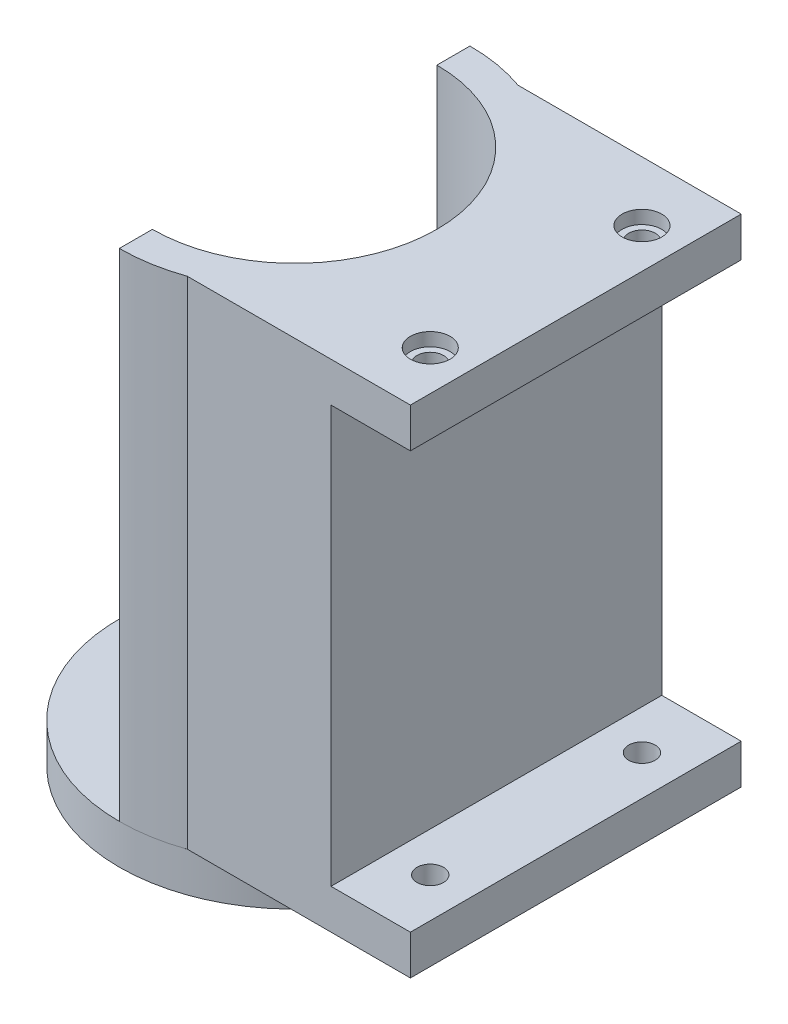
ISO-10303-21;
HEADER;
FILE_DESCRIPTION(('STEP AP214'),'2;1');
FILE_NAME('part.step','',(''),(''),'','','');
FILE_SCHEMA(('AUTOMOTIVE_DESIGN { 1 0 10303 214 1 1 1 1 }'));
ENDSEC;
DATA;
#1=APPLICATION_CONTEXT('core data for automotive mechanical design processes');
#2=APPLICATION_PROTOCOL_DEFINITION('international standard','automotive_design',2000,#1);
#3=PRODUCT_CONTEXT('',#1,'mechanical');
#4=PRODUCT('Part','Part','',(#3));
#5=PRODUCT_RELATED_PRODUCT_CATEGORY('part','',(#4));
#6=PRODUCT_DEFINITION_FORMATION('','',#4);
#7=PRODUCT_DEFINITION_CONTEXT('part definition',#1,'design');
#8=PRODUCT_DEFINITION('design','',#6,#7);
#9=PRODUCT_DEFINITION_SHAPE('','',#8);
#10=(LENGTH_UNIT() NAMED_UNIT(*) SI_UNIT(.MILLI.,.METRE.));
#11=(NAMED_UNIT(*) PLANE_ANGLE_UNIT() SI_UNIT($,.RADIAN.));
#12=(NAMED_UNIT(*) SI_UNIT($,.STERADIAN.) SOLID_ANGLE_UNIT());
#13=UNCERTAINTY_MEASURE_WITH_UNIT(LENGTH_MEASURE(1.E-05),#10,'distance_accuracy_value','');
#14=(GEOMETRIC_REPRESENTATION_CONTEXT(3) GLOBAL_UNCERTAINTY_ASSIGNED_CONTEXT((#13)) GLOBAL_UNIT_ASSIGNED_CONTEXT((#10,
#11,#12)) REPRESENTATION_CONTEXT('',''));
#15=CARTESIAN_POINT('',(0.,0.,0.));
#16=DIRECTION('',(0.,0.,1.));
#17=DIRECTION('',(1.,0.,0.));
#18=AXIS2_PLACEMENT_3D('',#15,#16,#17);
#19=CARTESIAN_POINT('',(18.25,0.,8.));
#20=DIRECTION('',(0.,1.,0.));
#21=DIRECTION('',(0.,0.,1.));
#22=AXIS2_PLACEMENT_3D('',#19,#20,#21);
#23=CYLINDRICAL_SURFACE('',#22,1.);
#24=CARTESIAN_POINT('',(18.25,6.,8.));
#25=DIRECTION('',(0.,-1.,0.));
#26=DIRECTION('',(0.,0.,-1.));
#27=AXIS2_PLACEMENT_3D('',#24,#25,#26);
#28=CIRCLE('',#27,1.);
#29=CARTESIAN_POINT('',(18.25,6.,7.));
#30=VERTEX_POINT('',#29);
#31=EDGE_CURVE('E233',#30,#30,#28,.T.);
#32=ORIENTED_EDGE('',*,*,#31,.F.);
#33=EDGE_LOOP('',(#32));
#34=FACE_BOUND('',#33,.T.);
#35=CARTESIAN_POINT('',(18.25,4.,8.));
#36=DIRECTION('',(0.,-1.,0.));
#37=DIRECTION('',(0.,0.,-1.));
#38=AXIS2_PLACEMENT_3D('',#35,#36,#37);
#39=CIRCLE('',#38,1.);
#40=CARTESIAN_POINT('',(18.25,4.,7.));
#41=VERTEX_POINT('',#40);
#42=EDGE_CURVE('E50',#41,#41,#39,.F.);
#43=ORIENTED_EDGE('',*,*,#42,.F.);
#44=EDGE_LOOP('',(#43));
#45=FACE_BOUND('',#44,.T.);
#46=ADVANCED_FACE('F46',(#34,#45),#23,.F.);
#47=CARTESIAN_POINT('',(18.25,0.,-8.));
#48=DIRECTION('',(0.,1.,0.));
#49=DIRECTION('',(0.,0.,1.));
#50=AXIS2_PLACEMENT_3D('',#47,#48,#49);
#51=CYLINDRICAL_SURFACE('',#50,1.);
#52=CARTESIAN_POINT('',(18.25,6.,-8.));
#53=DIRECTION('',(0.,-1.,0.));
#54=DIRECTION('',(0.,0.,-1.));
#55=AXIS2_PLACEMENT_3D('',#52,#53,#54);
#56=CIRCLE('',#55,1.);
#57=CARTESIAN_POINT('',(18.25,6.,-9.));
#58=VERTEX_POINT('',#57);
#59=EDGE_CURVE('E238',#58,#58,#56,.T.);
#60=ORIENTED_EDGE('',*,*,#59,.F.);
#61=EDGE_LOOP('',(#60));
#62=FACE_BOUND('',#61,.T.);
#63=CARTESIAN_POINT('',(18.25,4.,-8.));
#64=DIRECTION('',(0.,-1.,0.));
#65=DIRECTION('',(0.,0.,-1.));
#66=AXIS2_PLACEMENT_3D('',#63,#64,#65);
#67=CIRCLE('',#66,1.);
#68=CARTESIAN_POINT('',(18.25,4.,-9.));
#69=VERTEX_POINT('',#68);
#70=EDGE_CURVE('E246',#69,#69,#67,.F.);
#71=ORIENTED_EDGE('',*,*,#70,.F.);
#72=EDGE_LOOP('',(#71));
#73=FACE_BOUND('',#72,.T.);
#74=ADVANCED_FACE('F286',(#62,#73),#51,.F.);
#75=CARTESIAN_POINT('',(18.25,37.5,8.));
#76=DIRECTION('',(0.,1.,0.));
#77=DIRECTION('',(0.,0.,1.));
#78=AXIS2_PLACEMENT_3D('',#75,#76,#77);
#79=CIRCLE('',#78,1.);
#80=CARTESIAN_POINT('',(18.25,37.5,9.));
#81=VERTEX_POINT('',#80);
#82=EDGE_CURVE('E236',#81,#81,#79,.T.);
#83=ORIENTED_EDGE('',*,*,#82,.F.);
#84=EDGE_LOOP('',(#83));
#85=FACE_BOUND('',#84,.T.);
#86=CARTESIAN_POINT('',(18.25,39.5,8.));
#87=DIRECTION('',(0.,1.,0.));
#88=DIRECTION('',(0.,0.,1.));
#89=AXIS2_PLACEMENT_3D('',#86,#87,#88);
#90=CIRCLE('',#89,1.);
#91=CARTESIAN_POINT('',(18.25,39.5,9.));
#92=VERTEX_POINT('',#91);
#93=EDGE_CURVE('E237',#92,#92,#90,.F.);
#94=ORIENTED_EDGE('',*,*,#93,.F.);
#95=EDGE_LOOP('',(#94));
#96=FACE_BOUND('',#95,.T.);
#97=ADVANCED_FACE('F282',(#85,#96),#23,.F.);
#98=CARTESIAN_POINT('',(18.25,37.5,-8.));
#99=DIRECTION('',(0.,1.,0.));
#100=DIRECTION('',(0.,0.,1.));
#101=AXIS2_PLACEMENT_3D('',#98,#99,#100);
#102=CIRCLE('',#101,1.);
#103=CARTESIAN_POINT('',(18.25,37.5,-7.));
#104=VERTEX_POINT('',#103);
#105=EDGE_CURVE('E162',#104,#104,#102,.T.);
#106=ORIENTED_EDGE('',*,*,#105,.F.);
#107=EDGE_LOOP('',(#106));
#108=FACE_BOUND('',#107,.T.);
#109=CARTESIAN_POINT('',(18.25,39.5,-8.));
#110=DIRECTION('',(0.,1.,0.));
#111=DIRECTION('',(0.,0.,1.));
#112=AXIS2_PLACEMENT_3D('',#109,#110,#111);
#113=CIRCLE('',#112,1.);
#114=CARTESIAN_POINT('',(18.25,39.5,-7.));
#115=VERTEX_POINT('',#114);
#116=EDGE_CURVE('E241',#115,#115,#113,.F.);
#117=ORIENTED_EDGE('',*,*,#116,.F.);
#118=EDGE_LOOP('',(#117));
#119=FACE_BOUND('',#118,.T.);
#120=ADVANCED_FACE('F285',(#108,#119),#51,.F.);
#121=CARTESIAN_POINT('',(15.25,0.,0.));
#122=DIRECTION('',(1.,0.,0.));
#123=DIRECTION('',(0.,0.,-1.));
#124=AXIS2_PLACEMENT_3D('',#121,#122,#123);
#125=PLANE('',#124);
#126=DIRECTION('',(0.,1.,0.));
#127=VECTOR('',#126,1.);
#128=CARTESIAN_POINT('',(15.25,0.,12.5));
#129=LINE('',#128,#127);
#130=CARTESIAN_POINT('',(15.25,6.,12.5));
#131=VERTEX_POINT('',#130);
#132=CARTESIAN_POINT('',(15.25,37.5,12.5));
#133=VERTEX_POINT('',#132);
#134=EDGE_CURVE('E68',#131,#133,#129,.T.);
#135=ORIENTED_EDGE('',*,*,#134,.F.);
#136=DIRECTION('',(0.,0.,1.));
#137=VECTOR('',#136,1.);
#138=CARTESIAN_POINT('',(15.25,6.,12.5));
#139=LINE('',#138,#137);
#140=CARTESIAN_POINT('',(15.25,6.,-12.5));
#141=VERTEX_POINT('',#140);
#142=EDGE_CURVE('E160',#141,#131,#139,.T.);
#143=ORIENTED_EDGE('',*,*,#142,.F.);
#144=DIRECTION('',(0.,1.,0.));
#145=VECTOR('',#144,1.);
#146=CARTESIAN_POINT('',(15.25,0.,-12.5));
#147=LINE('',#146,#145);
#148=CARTESIAN_POINT('',(15.25,37.5,-12.5));
#149=VERTEX_POINT('',#148);
#150=EDGE_CURVE('E192',#141,#149,#147,.T.);
#151=ORIENTED_EDGE('',*,*,#150,.T.);
#152=DIRECTION('',(0.,0.,-1.));
#153=VECTOR('',#152,1.);
#154=CARTESIAN_POINT('',(15.25,37.5,12.5));
#155=LINE('',#154,#153);
#156=EDGE_CURVE('E172',#133,#149,#155,.T.);
#157=ORIENTED_EDGE('',*,*,#156,.F.);
#158=EDGE_LOOP('',(#135,#143,#151,#157));
#159=FACE_BOUND('',#158,.T.);
#160=ADVANCED_FACE('F330',(#159),#125,.T.);
#161=CARTESIAN_POINT('',(0.,40.5,0.));
#162=DIRECTION('',(0.,-1.,0.));
#163=DIRECTION('',(0.,0.,-1.));
#164=AXIS2_PLACEMENT_3D('',#161,#162,#163);
#165=CYLINDRICAL_SURFACE('',#164,13.25);
#166=DIRECTION('',(0.,-1.,0.));
#167=VECTOR('',#166,1.);
#168=CARTESIAN_POINT('',(4.39459895781175,40.5,12.5));
#169=LINE('',#168,#167);
#170=CARTESIAN_POINT('',(4.39459895781175,3.,12.5));
#171=VERTEX_POINT('',#170);
#172=CARTESIAN_POINT('',(4.39459895781175,40.5,12.5));
#173=VERTEX_POINT('',#172);
#174=EDGE_CURVE('E143',#171,#173,#169,.F.);
#175=ORIENTED_EDGE('',*,*,#174,.T.);
#176=CARTESIAN_POINT('',(0.,40.5,0.));
#177=DIRECTION('',(0.,1.,0.));
#178=DIRECTION('',(0.,0.,1.));
#179=AXIS2_PLACEMENT_3D('',#176,#177,#178);
#180=CIRCLE('',#179,13.25);
#181=CARTESIAN_POINT('',(0.,40.5,13.25));
#182=VERTEX_POINT('',#181);
#183=EDGE_CURVE('E209',#182,#173,#180,.T.);
#184=ORIENTED_EDGE('',*,*,#183,.F.);
#185=DIRECTION('',(0.,-1.,0.));
#186=VECTOR('',#185,1.);
#187=CARTESIAN_POINT('',(0.,40.5,13.25));
#188=LINE('',#187,#186);
#189=CARTESIAN_POINT('',(0.,3.,13.25));
#190=VERTEX_POINT('',#189);
#191=EDGE_CURVE('E12',#182,#190,#188,.T.);
#192=ORIENTED_EDGE('',*,*,#191,.T.);
#193=CARTESIAN_POINT('',(0.,3.,0.));
#194=DIRECTION('',(0.,1.,0.));
#195=DIRECTION('',(0.,0.,1.));
#196=AXIS2_PLACEMENT_3D('',#193,#194,#195);
#197=CIRCLE('',#196,13.25);
#198=EDGE_CURVE('E221',#190,#171,#197,.T.);
#199=ORIENTED_EDGE('',*,*,#198,.T.);
#200=EDGE_LOOP('',(#175,#184,#192,#199));
#201=FACE_BOUND('',#200,.T.);
#202=ADVANCED_FACE('F333',(#201),#165,.T.);
#203=CARTESIAN_POINT('',(0.,40.5,10.75));
#204=DIRECTION('',(1.,0.,0.));
#205=DIRECTION('',(0.,0.,-1.));
#206=AXIS2_PLACEMENT_3D('',#203,#204,#205);
#207=PLANE('',#206);
#208=DIRECTION('',(0.,0.,1.));
#209=VECTOR('',#208,1.);
#210=CARTESIAN_POINT('',(0.,3.,10.75));
#211=LINE('',#210,#209);
#212=CARTESIAN_POINT('',(0.,3.,10.75));
#213=VERTEX_POINT('',#212);
#214=EDGE_CURVE('E203',#213,#190,#211,.T.);
#215=ORIENTED_EDGE('',*,*,#214,.T.);
#216=ORIENTED_EDGE('',*,*,#191,.F.);
#217=DIRECTION('',(0.,0.,1.));
#218=VECTOR('',#217,1.);
#219=CARTESIAN_POINT('',(0.,40.5,10.75));
#220=LINE('',#219,#218);
#221=CARTESIAN_POINT('',(0.,40.5,10.75));
#222=VERTEX_POINT('',#221);
#223=EDGE_CURVE('E204',#222,#182,#220,.T.);
#224=ORIENTED_EDGE('',*,*,#223,.F.);
#225=DIRECTION('',(0.,-1.,0.));
#226=VECTOR('',#225,1.);
#227=CARTESIAN_POINT('',(0.,40.5,10.75));
#228=LINE('',#227,#226);
#229=EDGE_CURVE('E217',#222,#213,#228,.T.);
#230=ORIENTED_EDGE('',*,*,#229,.T.);
#231=EDGE_LOOP('',(#215,#216,#224,#230));
#232=FACE_BOUND('',#231,.T.);
#233=ADVANCED_FACE('F48',(#232),#207,.F.);
#234=CARTESIAN_POINT('',(4.39459895781173,40.5,-12.5));
#235=VERTEX_POINT('',#234);
#236=CARTESIAN_POINT('',(0.,40.5,-13.25));
#237=VERTEX_POINT('',#236);
#238=EDGE_CURVE('E207',#235,#237,#180,.T.);
#239=ORIENTED_EDGE('',*,*,#238,.F.);
#240=DIRECTION('',(0.,-1.,0.));
#241=VECTOR('',#240,1.);
#242=CARTESIAN_POINT('',(4.39459895781173,40.5,-12.5));
#243=LINE('',#242,#241);
#244=CARTESIAN_POINT('',(4.39459895781173,3.,-12.5));
#245=VERTEX_POINT('',#244);
#246=EDGE_CURVE('E145',#245,#235,#243,.F.);
#247=ORIENTED_EDGE('',*,*,#246,.F.);
#248=CARTESIAN_POINT('',(0.,3.,-13.25));
#249=VERTEX_POINT('',#248);
#250=EDGE_CURVE('E220',#245,#249,#197,.T.);
#251=ORIENTED_EDGE('',*,*,#250,.T.);
#252=DIRECTION('',(0.,-1.,0.));
#253=VECTOR('',#252,1.);
#254=CARTESIAN_POINT('',(0.,40.5,-13.25));
#255=LINE('',#254,#253);
#256=EDGE_CURVE('E55',#237,#249,#255,.T.);
#257=ORIENTED_EDGE('',*,*,#256,.F.);
#258=EDGE_LOOP('',(#239,#247,#251,#257));
#259=FACE_BOUND('',#258,.T.);
#260=ADVANCED_FACE('F353',(#259),#165,.T.);
#261=CARTESIAN_POINT('',(0.,40.5,-13.25));
#262=DIRECTION('',(1.,0.,0.));
#263=DIRECTION('',(0.,0.,-1.));
#264=AXIS2_PLACEMENT_3D('',#261,#262,#263);
#265=PLANE('',#264);
#266=DIRECTION('',(0.,0.,1.));
#267=VECTOR('',#266,1.);
#268=CARTESIAN_POINT('',(0.,3.,-13.25));
#269=LINE('',#268,#267);
#270=CARTESIAN_POINT('',(0.,3.,-10.75));
#271=VERTEX_POINT('',#270);
#272=EDGE_CURVE('E223',#249,#271,#269,.T.);
#273=ORIENTED_EDGE('',*,*,#272,.T.);
#274=DIRECTION('',(0.,-1.,0.));
#275=VECTOR('',#274,1.);
#276=CARTESIAN_POINT('',(0.,40.5,-10.75));
#277=LINE('',#276,#275);
#278=CARTESIAN_POINT('',(0.,40.5,-10.75));
#279=VERTEX_POINT('',#278);
#280=EDGE_CURVE('E229',#279,#271,#277,.T.);
#281=ORIENTED_EDGE('',*,*,#280,.F.);
#282=DIRECTION('',(0.,0.,1.));
#283=VECTOR('',#282,1.);
#284=CARTESIAN_POINT('',(0.,40.5,-13.25));
#285=LINE('',#284,#283);
#286=EDGE_CURVE('E212',#237,#279,#285,.T.);
#287=ORIENTED_EDGE('',*,*,#286,.F.);
#288=ORIENTED_EDGE('',*,*,#256,.T.);
#289=EDGE_LOOP('',(#273,#281,#287,#288));
#290=FACE_BOUND('',#289,.T.);
#291=ADVANCED_FACE('F350',(#290),#265,.F.);
#292=CARTESIAN_POINT('',(0.,40.5,0.));
#293=DIRECTION('',(0.,-1.,0.));
#294=DIRECTION('',(0.,0.,-1.));
#295=AXIS2_PLACEMENT_3D('',#292,#293,#294);
#296=CYLINDRICAL_SURFACE('',#295,10.75);
#297=CARTESIAN_POINT('',(0.,3.,0.));
#298=DIRECTION('',(0.,1.,0.));
#299=DIRECTION('',(0.,0.,1.));
#300=AXIS2_PLACEMENT_3D('',#297,#298,#299);
#301=CIRCLE('',#300,10.75);
#302=EDGE_CURVE('E208',#213,#271,#301,.T.);
#303=ORIENTED_EDGE('',*,*,#302,.F.);
#304=ORIENTED_EDGE('',*,*,#229,.F.);
#305=CARTESIAN_POINT('',(0.,40.5,0.));
#306=DIRECTION('',(0.,1.,0.));
#307=DIRECTION('',(0.,0.,1.));
#308=AXIS2_PLACEMENT_3D('',#305,#306,#307);
#309=CIRCLE('',#308,10.75);
#310=EDGE_CURVE('E214',#222,#279,#309,.T.);
#311=ORIENTED_EDGE('',*,*,#310,.T.);
#312=ORIENTED_EDGE('',*,*,#280,.T.);
#313=EDGE_LOOP('',(#303,#304,#311,#312));
#314=FACE_BOUND('',#313,.T.);
#315=ADVANCED_FACE('F343',(#314),#296,.F.);
#316=CARTESIAN_POINT('',(0.,40.5,0.));
#317=DIRECTION('',(0.,1.,0.));
#318=DIRECTION('',(0.,0.,1.));
#319=AXIS2_PLACEMENT_3D('',#316,#317,#318);
#320=PLANE('',#319);
#321=CARTESIAN_POINT('',(18.25,40.5,-8.));
#322=DIRECTION('',(0.,1.,0.));
#323=DIRECTION('',(0.,0.,1.));
#324=AXIS2_PLACEMENT_3D('',#321,#322,#323);
#325=CIRCLE('',#324,1.5);
#326=CARTESIAN_POINT('',(18.25,40.5,-6.5));
#327=VERTEX_POINT('',#326);
#328=EDGE_CURVE('E269',#327,#327,#325,.T.);
#329=ORIENTED_EDGE('',*,*,#328,.F.);
#330=EDGE_LOOP('',(#329));
#331=FACE_BOUND('',#330,.T.);
#332=CARTESIAN_POINT('',(18.25,40.5,8.));
#333=DIRECTION('',(0.,1.,0.));
#334=DIRECTION('',(0.,0.,1.));
#335=AXIS2_PLACEMENT_3D('',#332,#333,#334);
#336=CIRCLE('',#335,1.5);
#337=CARTESIAN_POINT('',(18.25,40.5,9.5));
#338=VERTEX_POINT('',#337);
#339=EDGE_CURVE('E252',#338,#338,#336,.T.);
#340=ORIENTED_EDGE('',*,*,#339,.F.);
#341=EDGE_LOOP('',(#340));
#342=FACE_BOUND('',#341,.T.);
#343=ORIENTED_EDGE('',*,*,#223,.T.);
#344=ORIENTED_EDGE('',*,*,#183,.T.);
#345=DIRECTION('',(1.,0.,0.));
#346=VECTOR('',#345,1.);
#347=CARTESIAN_POINT('',(-0.00200000000000027,40.5,12.5));
#348=LINE('',#347,#346);
#349=CARTESIAN_POINT('',(21.25,40.5,12.5));
#350=VERTEX_POINT('',#349);
#351=EDGE_CURVE('E194',#173,#350,#348,.T.);
#352=ORIENTED_EDGE('',*,*,#351,.T.);
#353=DIRECTION('',(0.,0.,1.));
#354=VECTOR('',#353,1.);
#355=CARTESIAN_POINT('',(21.25,40.5,12.5));
#356=LINE('',#355,#354);
#357=CARTESIAN_POINT('',(21.25,40.5,-12.5));
#358=VERTEX_POINT('',#357);
#359=EDGE_CURVE('E181',#358,#350,#356,.T.);
#360=ORIENTED_EDGE('',*,*,#359,.F.);
#361=DIRECTION('',(1.,0.,0.));
#362=VECTOR('',#361,1.);
#363=CARTESIAN_POINT('',(-0.00200000000000027,40.5,-12.5));
#364=LINE('',#363,#362);
#365=EDGE_CURVE('E196',#235,#358,#364,.T.);
#366=ORIENTED_EDGE('',*,*,#365,.F.);
#367=ORIENTED_EDGE('',*,*,#238,.T.);
#368=ORIENTED_EDGE('',*,*,#286,.T.);
#369=ORIENTED_EDGE('',*,*,#310,.F.);
#370=EDGE_LOOP('',(#343,#344,#352,#360,#366,#367,#368,#369));
#371=FACE_BOUND('',#370,.T.);
#372=ADVANCED_FACE('F340',(#331,#342,#371),#320,.T.);
#373=CARTESIAN_POINT('',(0.,3.,0.));
#374=DIRECTION('',(0.,1.,0.));
#375=DIRECTION('',(0.,0.,1.));
#376=AXIS2_PLACEMENT_3D('',#373,#374,#375);
#377=PLANE('',#376);
#378=CARTESIAN_POINT('',(18.25,3.,8.));
#379=DIRECTION('',(0.,-1.,0.));
#380=DIRECTION('',(0.,0.,-1.));
#381=AXIS2_PLACEMENT_3D('',#378,#379,#380);
#382=CIRCLE('',#381,1.5);
#383=CARTESIAN_POINT('',(18.25,3.,6.5));
#384=VERTEX_POINT('',#383);
#385=EDGE_CURVE('E254',#384,#384,#382,.T.);
#386=ORIENTED_EDGE('',*,*,#385,.F.);
#387=EDGE_LOOP('',(#386));
#388=FACE_BOUND('',#387,.T.);
#389=CARTESIAN_POINT('',(18.25,3.,-8.));
#390=DIRECTION('',(0.,-1.,0.));
#391=DIRECTION('',(0.,0.,-1.));
#392=AXIS2_PLACEMENT_3D('',#389,#390,#391);
#393=CIRCLE('',#392,1.5);
#394=CARTESIAN_POINT('',(18.25,3.,-9.5));
#395=VERTEX_POINT('',#394);
#396=EDGE_CURVE('E264',#395,#395,#393,.T.);
#397=ORIENTED_EDGE('',*,*,#396,.F.);
#398=EDGE_LOOP('',(#397));
#399=FACE_BOUND('',#398,.T.);
#400=ORIENTED_EDGE('',*,*,#214,.F.);
#401=ORIENTED_EDGE('',*,*,#302,.T.);
#402=ORIENTED_EDGE('',*,*,#272,.F.);
#403=ORIENTED_EDGE('',*,*,#250,.F.);
#404=DIRECTION('',(1.,0.,0.));
#405=VECTOR('',#404,1.);
#406=CARTESIAN_POINT('',(-0.00200000000000027,3.,-12.5));
#407=LINE('',#406,#405);
#408=CARTESIAN_POINT('',(21.25,3.,-12.5));
#409=VERTEX_POINT('',#408);
#410=EDGE_CURVE('E146',#245,#409,#407,.T.);
#411=ORIENTED_EDGE('',*,*,#410,.T.);
#412=DIRECTION('',(0.,0.,-1.));
#413=VECTOR('',#412,1.);
#414=CARTESIAN_POINT('',(21.25,3.,12.5));
#415=LINE('',#414,#413);
#416=CARTESIAN_POINT('',(21.25,3.,12.5));
#417=VERTEX_POINT('',#416);
#418=EDGE_CURVE('E149',#417,#409,#415,.T.);
#419=ORIENTED_EDGE('',*,*,#418,.F.);
#420=DIRECTION('',(1.,0.,0.));
#421=VECTOR('',#420,1.);
#422=CARTESIAN_POINT('',(-0.00200000000000027,3.,12.5));
#423=LINE('',#422,#421);
#424=EDGE_CURVE('E137',#171,#417,#423,.T.);
#425=ORIENTED_EDGE('',*,*,#424,.F.);
#426=ORIENTED_EDGE('',*,*,#198,.F.);
#427=EDGE_LOOP('',(#400,#401,#402,#403,#411,#419,#425,#426));
#428=FACE_BOUND('',#427,.T.);
#429=ADVANCED_FACE('F151',(#388,#399,#428),#377,.F.);
#430=CARTESIAN_POINT('',(-0.00200000000000027,0.,-12.5));
#431=DIRECTION('',(0.,0.,-1.));
#432=DIRECTION('',(0.,1.,0.));
#433=AXIS2_PLACEMENT_3D('',#430,#431,#432);
#434=PLANE('',#433);
#435=ORIENTED_EDGE('',*,*,#410,.F.);
#436=ORIENTED_EDGE('',*,*,#246,.T.);
#437=ORIENTED_EDGE('',*,*,#365,.T.);
#438=DIRECTION('',(0.,1.,0.));
#439=VECTOR('',#438,1.);
#440=CARTESIAN_POINT('',(21.25,40.5,-12.5));
#441=LINE('',#440,#439);
#442=CARTESIAN_POINT('',(21.25,37.5,-12.5));
#443=VERTEX_POINT('',#442);
#444=EDGE_CURVE('E178',#443,#358,#441,.T.);
#445=ORIENTED_EDGE('',*,*,#444,.F.);
#446=DIRECTION('',(-1.,0.,0.));
#447=VECTOR('',#446,1.);
#448=CARTESIAN_POINT('',(21.25,37.5,-12.5));
#449=LINE('',#448,#447);
#450=EDGE_CURVE('E184',#443,#149,#449,.T.);
#451=ORIENTED_EDGE('',*,*,#450,.T.);
#452=ORIENTED_EDGE('',*,*,#150,.F.);
#453=DIRECTION('',(-1.,0.,0.));
#454=VECTOR('',#453,1.);
#455=CARTESIAN_POINT('',(21.25,6.,-12.5));
#456=LINE('',#455,#454);
#457=CARTESIAN_POINT('',(21.25,6.,-12.5));
#458=VERTEX_POINT('',#457);
#459=EDGE_CURVE('E170',#458,#141,#456,.T.);
#460=ORIENTED_EDGE('',*,*,#459,.F.);
#461=DIRECTION('',(0.,1.,0.));
#462=VECTOR('',#461,1.);
#463=CARTESIAN_POINT('',(21.25,3.,-12.5));
#464=LINE('',#463,#462);
#465=EDGE_CURVE('E155',#409,#458,#464,.T.);
#466=ORIENTED_EDGE('',*,*,#465,.F.);
#467=EDGE_LOOP('',(#435,#436,#437,#445,#451,#452,#460,#466));
#468=FACE_BOUND('',#467,.T.);
#469=ADVANCED_FACE('F329',(#468),#434,.T.);
#470=CARTESIAN_POINT('',(-0.00200000000000027,0.,12.5));
#471=DIRECTION('',(0.,0.,-1.));
#472=DIRECTION('',(-1.,0.,0.));
#473=AXIS2_PLACEMENT_3D('',#470,#471,#472);
#474=PLANE('',#473);
#475=ORIENTED_EDGE('',*,*,#174,.F.);
#476=ORIENTED_EDGE('',*,*,#424,.T.);
#477=DIRECTION('',(0.,-1.,0.));
#478=VECTOR('',#477,1.);
#479=CARTESIAN_POINT('',(21.25,3.,12.5));
#480=LINE('',#479,#478);
#481=CARTESIAN_POINT('',(21.25,6.,12.5));
#482=VERTEX_POINT('',#481);
#483=EDGE_CURVE('E141',#482,#417,#480,.T.);
#484=ORIENTED_EDGE('',*,*,#483,.F.);
#485=DIRECTION('',(-1.,0.,0.));
#486=VECTOR('',#485,1.);
#487=CARTESIAN_POINT('',(21.25,6.,12.5));
#488=LINE('',#487,#486);
#489=EDGE_CURVE('E63',#482,#131,#488,.T.);
#490=ORIENTED_EDGE('',*,*,#489,.T.);
#491=ORIENTED_EDGE('',*,*,#134,.T.);
#492=DIRECTION('',(-1.,0.,0.));
#493=VECTOR('',#492,1.);
#494=CARTESIAN_POINT('',(21.25,37.5,12.5));
#495=LINE('',#494,#493);
#496=CARTESIAN_POINT('',(21.25,37.5,12.5));
#497=VERTEX_POINT('',#496);
#498=EDGE_CURVE('E189',#497,#133,#495,.T.);
#499=ORIENTED_EDGE('',*,*,#498,.F.);
#500=DIRECTION('',(0.,-1.,0.));
#501=VECTOR('',#500,1.);
#502=CARTESIAN_POINT('',(21.25,40.5,12.5));
#503=LINE('',#502,#501);
#504=EDGE_CURVE('E173',#350,#497,#503,.T.);
#505=ORIENTED_EDGE('',*,*,#504,.F.);
#506=ORIENTED_EDGE('',*,*,#351,.F.);
#507=EDGE_LOOP('',(#475,#476,#484,#490,#491,#499,#505,#506));
#508=FACE_BOUND('',#507,.T.);
#509=ADVANCED_FACE('F139',(#508),#474,.F.);
#510=CARTESIAN_POINT('',(21.25,37.5,12.5));
#511=DIRECTION('',(0.,1.,0.));
#512=DIRECTION('',(0.,0.,1.));
#513=AXIS2_PLACEMENT_3D('',#510,#511,#512);
#514=PLANE('',#513);
#515=ORIENTED_EDGE('',*,*,#105,.T.);
#516=EDGE_LOOP('',(#515));
#517=FACE_BOUND('',#516,.T.);
#518=ORIENTED_EDGE('',*,*,#82,.T.);
#519=EDGE_LOOP('',(#518));
#520=FACE_BOUND('',#519,.T.);
#521=ORIENTED_EDGE('',*,*,#156,.T.);
#522=ORIENTED_EDGE('',*,*,#450,.F.);
#523=DIRECTION('',(0.,0.,-1.));
#524=VECTOR('',#523,1.);
#525=CARTESIAN_POINT('',(21.25,37.5,12.5));
#526=LINE('',#525,#524);
#527=EDGE_CURVE('E176',#497,#443,#526,.T.);
#528=ORIENTED_EDGE('',*,*,#527,.F.);
#529=ORIENTED_EDGE('',*,*,#498,.T.);
#530=EDGE_LOOP('',(#521,#522,#528,#529));
#531=FACE_BOUND('',#530,.T.);
#532=ADVANCED_FACE('F279',(#517,#520,#531),#514,.F.);
#533=CARTESIAN_POINT('',(21.25,0.,0.));
#534=DIRECTION('',(1.,0.,0.));
#535=DIRECTION('',(0.,0.,-1.));
#536=AXIS2_PLACEMENT_3D('',#533,#534,#535);
#537=PLANE('',#536);
#538=ORIENTED_EDGE('',*,*,#504,.T.);
#539=ORIENTED_EDGE('',*,*,#527,.T.);
#540=ORIENTED_EDGE('',*,*,#444,.T.);
#541=ORIENTED_EDGE('',*,*,#359,.T.);
#542=EDGE_LOOP('',(#538,#539,#540,#541));
#543=FACE_BOUND('',#542,.T.);
#544=ADVANCED_FACE('F321',(#543),#537,.T.);
#545=CARTESIAN_POINT('',(21.25,6.,12.5));
#546=DIRECTION('',(0.,-1.,0.));
#547=DIRECTION('',(0.,0.,-1.));
#548=AXIS2_PLACEMENT_3D('',#545,#546,#547);
#549=PLANE('',#548);
#550=ORIENTED_EDGE('',*,*,#59,.T.);
#551=EDGE_LOOP('',(#550));
#552=FACE_BOUND('',#551,.T.);
#553=ORIENTED_EDGE('',*,*,#31,.T.);
#554=EDGE_LOOP('',(#553));
#555=FACE_BOUND('',#554,.T.);
#556=ORIENTED_EDGE('',*,*,#142,.T.);
#557=ORIENTED_EDGE('',*,*,#489,.F.);
#558=DIRECTION('',(0.,0.,1.));
#559=VECTOR('',#558,1.);
#560=CARTESIAN_POINT('',(21.25,6.,12.5));
#561=LINE('',#560,#559);
#562=EDGE_CURVE('E159',#458,#482,#561,.T.);
#563=ORIENTED_EDGE('',*,*,#562,.F.);
#564=ORIENTED_EDGE('',*,*,#459,.T.);
#565=EDGE_LOOP('',(#556,#557,#563,#564));
#566=FACE_BOUND('',#565,.T.);
#567=ADVANCED_FACE('F318',(#552,#555,#566),#549,.F.);
#568=CARTESIAN_POINT('',(21.25,0.,0.));
#569=DIRECTION('',(-1.,0.,0.));
#570=DIRECTION('',(0.,0.,1.));
#571=AXIS2_PLACEMENT_3D('',#568,#569,#570);
#572=PLANE('',#571);
#573=ORIENTED_EDGE('',*,*,#483,.T.);
#574=ORIENTED_EDGE('',*,*,#418,.T.);
#575=ORIENTED_EDGE('',*,*,#465,.T.);
#576=ORIENTED_EDGE('',*,*,#562,.T.);
#577=EDGE_LOOP('',(#573,#574,#575,#576));
#578=FACE_BOUND('',#577,.T.);
#579=ADVANCED_FACE('F157',(#578),#572,.F.);
#580=CARTESIAN_POINT('',(18.25,39.5,-8.));
#581=DIRECTION('',(0.,1.,0.));
#582=DIRECTION('',(0.,0.,1.));
#583=AXIS2_PLACEMENT_3D('',#580,#581,#582);
#584=PLANE('',#583);
#585=CARTESIAN_POINT('',(18.25,39.5,-8.));
#586=DIRECTION('',(0.,1.,0.));
#587=DIRECTION('',(0.,0.,1.));
#588=AXIS2_PLACEMENT_3D('',#585,#586,#587);
#589=CIRCLE('',#588,1.5);
#590=CARTESIAN_POINT('',(18.25,39.5,-6.5));
#591=VERTEX_POINT('',#590);
#592=EDGE_CURVE('E244',#591,#591,#589,.T.);
#593=ORIENTED_EDGE('',*,*,#592,.T.);
#594=EDGE_LOOP('',(#593));
#595=FACE_BOUND('',#594,.T.);
#596=ORIENTED_EDGE('',*,*,#116,.T.);
#597=EDGE_LOOP('',(#596));
#598=FACE_BOUND('',#597,.T.);
#599=ADVANCED_FACE('F303',(#595,#598),#584,.T.);
#600=CARTESIAN_POINT('',(18.25,39.5,-8.));
#601=DIRECTION('',(0.,1.,0.));
#602=DIRECTION('',(0.,0.,1.));
#603=AXIS2_PLACEMENT_3D('',#600,#601,#602);
#604=CYLINDRICAL_SURFACE('',#603,1.5);
#605=ORIENTED_EDGE('',*,*,#592,.F.);
#606=EDGE_LOOP('',(#605));
#607=FACE_BOUND('',#606,.T.);
#608=ORIENTED_EDGE('',*,*,#328,.T.);
#609=EDGE_LOOP('',(#608));
#610=FACE_BOUND('',#609,.T.);
#611=ADVANCED_FACE('F293',(#607,#610),#604,.F.);
#612=CARTESIAN_POINT('',(18.25,39.5,8.));
#613=DIRECTION('',(0.,1.,0.));
#614=DIRECTION('',(0.,0.,1.));
#615=AXIS2_PLACEMENT_3D('',#612,#613,#614);
#616=PLANE('',#615);
#617=CARTESIAN_POINT('',(18.25,39.5,8.));
#618=DIRECTION('',(0.,1.,0.));
#619=DIRECTION('',(0.,0.,1.));
#620=AXIS2_PLACEMENT_3D('',#617,#618,#619);
#621=CIRCLE('',#620,1.5);
#622=CARTESIAN_POINT('',(18.25,39.5,9.5));
#623=VERTEX_POINT('',#622);
#624=EDGE_CURVE('E272',#623,#623,#621,.T.);
#625=ORIENTED_EDGE('',*,*,#624,.T.);
#626=EDGE_LOOP('',(#625));
#627=FACE_BOUND('',#626,.T.);
#628=ORIENTED_EDGE('',*,*,#93,.T.);
#629=EDGE_LOOP('',(#628));
#630=FACE_BOUND('',#629,.T.);
#631=ADVANCED_FACE('F290',(#627,#630),#616,.T.);
#632=CARTESIAN_POINT('',(18.25,39.5,8.));
#633=DIRECTION('',(0.,1.,0.));
#634=DIRECTION('',(0.,0.,1.));
#635=AXIS2_PLACEMENT_3D('',#632,#633,#634);
#636=CYLINDRICAL_SURFACE('',#635,1.5);
#637=ORIENTED_EDGE('',*,*,#624,.F.);
#638=EDGE_LOOP('',(#637));
#639=FACE_BOUND('',#638,.T.);
#640=ORIENTED_EDGE('',*,*,#339,.T.);
#641=EDGE_LOOP('',(#640));
#642=FACE_BOUND('',#641,.T.);
#643=ADVANCED_FACE('F292',(#639,#642),#636,.F.);
#644=CARTESIAN_POINT('',(18.25,4.,-8.));
#645=DIRECTION('',(0.,-1.,0.));
#646=DIRECTION('',(0.,0.,-1.));
#647=AXIS2_PLACEMENT_3D('',#644,#645,#646);
#648=PLANE('',#647);
#649=CARTESIAN_POINT('',(18.25,4.,-8.));
#650=DIRECTION('',(0.,-1.,0.));
#651=DIRECTION('',(0.,0.,-1.));
#652=AXIS2_PLACEMENT_3D('',#649,#650,#651);
#653=CIRCLE('',#652,1.5);
#654=CARTESIAN_POINT('',(18.25,4.,-9.5));
#655=VERTEX_POINT('',#654);
#656=EDGE_CURVE('E259',#655,#655,#653,.T.);
#657=ORIENTED_EDGE('',*,*,#656,.T.);
#658=EDGE_LOOP('',(#657));
#659=FACE_BOUND('',#658,.T.);
#660=ORIENTED_EDGE('',*,*,#70,.T.);
#661=EDGE_LOOP('',(#660));
#662=FACE_BOUND('',#661,.T.);
#663=ADVANCED_FACE('F300',(#659,#662),#648,.T.);
#664=CARTESIAN_POINT('',(18.25,4.,-8.));
#665=DIRECTION('',(0.,-1.,0.));
#666=DIRECTION('',(0.,0.,-1.));
#667=AXIS2_PLACEMENT_3D('',#664,#665,#666);
#668=CYLINDRICAL_SURFACE('',#667,1.5);
#669=ORIENTED_EDGE('',*,*,#656,.F.);
#670=EDGE_LOOP('',(#669));
#671=FACE_BOUND('',#670,.T.);
#672=ORIENTED_EDGE('',*,*,#396,.T.);
#673=EDGE_LOOP('',(#672));
#674=FACE_BOUND('',#673,.T.);
#675=ADVANCED_FACE('F551',(#671,#674),#668,.F.);
#676=CARTESIAN_POINT('',(18.25,4.,8.));
#677=DIRECTION('',(0.,-1.,0.));
#678=DIRECTION('',(0.,0.,-1.));
#679=AXIS2_PLACEMENT_3D('',#676,#677,#678);
#680=PLANE('',#679);
#681=CARTESIAN_POINT('',(18.25,4.,8.));
#682=DIRECTION('',(0.,-1.,0.));
#683=DIRECTION('',(0.,0.,-1.));
#684=AXIS2_PLACEMENT_3D('',#681,#682,#683);
#685=CIRCLE('',#684,1.5);
#686=CARTESIAN_POINT('',(18.25,4.,6.5));
#687=VERTEX_POINT('',#686);
#688=EDGE_CURVE('E248',#687,#687,#685,.T.);
#689=ORIENTED_EDGE('',*,*,#688,.T.);
#690=EDGE_LOOP('',(#689));
#691=FACE_BOUND('',#690,.T.);
#692=ORIENTED_EDGE('',*,*,#42,.T.);
#693=EDGE_LOOP('',(#692));
#694=FACE_BOUND('',#693,.T.);
#695=ADVANCED_FACE('F560',(#691,#694),#680,.T.);
#696=CARTESIAN_POINT('',(18.25,4.,8.));
#697=DIRECTION('',(0.,-1.,0.));
#698=DIRECTION('',(0.,0.,-1.));
#699=AXIS2_PLACEMENT_3D('',#696,#697,#698);
#700=CYLINDRICAL_SURFACE('',#699,1.5);
#701=ORIENTED_EDGE('',*,*,#688,.F.);
#702=EDGE_LOOP('',(#701));
#703=FACE_BOUND('',#702,.T.);
#704=ORIENTED_EDGE('',*,*,#385,.T.);
#705=EDGE_LOOP('',(#704));
#706=FACE_BOUND('',#705,.T.);
#707=ADVANCED_FACE('F569',(#703,#706),#700,.F.);
#708=CLOSED_SHELL('',(#46,#74,#97,#120,#160,#202,#233,#260,#291,#315,#372,#429,#469,#509,#532,
#544,#567,#579,#599,#611,#631,#643,#663,#675,#695,#707));
#709=MANIFOLD_SOLID_BREP('B2',#708);
#710=CARTESIAN_POINT('',(0.,3.,0.));
#711=DIRECTION('',(0.,1.,0.));
#712=DIRECTION('',(0.,0.,1.));
#713=AXIS2_PLACEMENT_3D('',#710,#711,#712);
#714=PLANE('',#713);
#715=CARTESIAN_POINT('',(8.,3.,0.));
#716=DIRECTION('',(0.,1.,0.));
#717=DIRECTION('',(0.,0.,1.));
#718=AXIS2_PLACEMENT_3D('',#715,#716,#717);
#719=CIRCLE('',#718,1.);
#720=CARTESIAN_POINT('',(8.,3.,1.00000000000006));
#721=VERTEX_POINT('',#720);
#722=EDGE_CURVE('E625',#721,#721,#719,.T.);
#723=ORIENTED_EDGE('',*,*,#722,.F.);
#724=EDGE_LOOP('',(#723));
#725=FACE_BOUND('',#724,.T.);
#726=CARTESIAN_POINT('',(-8.,3.,0.));
#727=DIRECTION('',(0.,1.,0.));
#728=DIRECTION('',(0.,0.,1.));
#729=AXIS2_PLACEMENT_3D('',#726,#727,#728);
#730=CIRCLE('',#729,1.);
#731=CARTESIAN_POINT('',(-8.,3.,1.));
#732=VERTEX_POINT('',#731);
#733=EDGE_CURVE('E614',#732,#732,#730,.T.);
#734=ORIENTED_EDGE('',*,*,#733,.F.);
#735=EDGE_LOOP('',(#734));
#736=FACE_BOUND('',#735,.T.);
#737=CARTESIAN_POINT('',(0.,3.,0.));
#738=DIRECTION('',(0.,1.,0.));
#739=DIRECTION('',(0.,0.,1.));
#740=AXIS2_PLACEMENT_3D('',#737,#738,#739);
#741=CIRCLE('',#740,13.25);
#742=CARTESIAN_POINT('',(0.,3.,13.25));
#743=VERTEX_POINT('',#742);
#744=EDGE_CURVE('E45',#743,#743,#741,.T.);
#745=ORIENTED_EDGE('',*,*,#744,.T.);
#746=EDGE_LOOP('',(#745));
#747=FACE_BOUND('',#746,.T.);
#748=CARTESIAN_POINT('',(0.,3.,-8.));
#749=DIRECTION('',(0.,1.,0.));
#750=DIRECTION('',(0.,0.,1.));
#751=AXIS2_PLACEMENT_3D('',#748,#749,#750);
#752=CIRCLE('',#751,1.);
#753=CARTESIAN_POINT('',(0.,3.,-7.));
#754=VERTEX_POINT('',#753);
#755=EDGE_CURVE('E619',#754,#754,#752,.T.);
#756=ORIENTED_EDGE('',*,*,#755,.F.);
#757=EDGE_LOOP('',(#756));
#758=FACE_BOUND('',#757,.T.);
#759=CARTESIAN_POINT('',(0.,3.,8.));
#760=DIRECTION('',(0.,1.,0.));
#761=DIRECTION('',(0.,0.,1.));
#762=AXIS2_PLACEMENT_3D('',#759,#760,#761);
#763=CIRCLE('',#762,1.);
#764=CARTESIAN_POINT('',(0.,3.,9.));
#765=VERTEX_POINT('',#764);
#766=EDGE_CURVE('E631',#765,#765,#763,.T.);
#767=ORIENTED_EDGE('',*,*,#766,.F.);
#768=EDGE_LOOP('',(#767));
#769=FACE_BOUND('',#768,.T.);
#770=ADVANCED_FACE('F603',(#725,#736,#747,#758,#769),#714,.T.);
#771=CARTESIAN_POINT('',(0.,0.,0.));
#772=DIRECTION('',(0.,1.,0.));
#773=DIRECTION('',(0.,0.,1.));
#774=AXIS2_PLACEMENT_3D('',#771,#772,#773);
#775=PLANE('',#774);
#776=CARTESIAN_POINT('',(0.,0.,0.));
#777=DIRECTION('',(0.,1.,0.));
#778=DIRECTION('',(0.,0.,1.));
#779=AXIS2_PLACEMENT_3D('',#776,#777,#778);
#780=CIRCLE('',#779,13.25);
#781=CARTESIAN_POINT('',(0.,0.,13.25));
#782=VERTEX_POINT('',#781);
#783=EDGE_CURVE('E607',#782,#782,#780,.T.);
#784=ORIENTED_EDGE('',*,*,#783,.F.);
#785=EDGE_LOOP('',(#784));
#786=FACE_BOUND('',#785,.T.);
#787=CARTESIAN_POINT('',(-8.,0.,0.));
#788=DIRECTION('',(0.,1.,0.));
#789=DIRECTION('',(0.,0.,1.));
#790=AXIS2_PLACEMENT_3D('',#787,#788,#789);
#791=CIRCLE('',#790,1.);
#792=CARTESIAN_POINT('',(-8.,0.,1.));
#793=VERTEX_POINT('',#792);
#794=EDGE_CURVE('E616',#793,#793,#791,.T.);
#795=ORIENTED_EDGE('',*,*,#794,.T.);
#796=EDGE_LOOP('',(#795));
#797=FACE_BOUND('',#796,.T.);
#798=CARTESIAN_POINT('',(0.,0.,-8.));
#799=DIRECTION('',(0.,1.,0.));
#800=DIRECTION('',(0.,0.,1.));
#801=AXIS2_PLACEMENT_3D('',#798,#799,#800);
#802=CIRCLE('',#801,1.);
#803=CARTESIAN_POINT('',(0.,0.,-7.));
#804=VERTEX_POINT('',#803);
#805=EDGE_CURVE('E622',#804,#804,#802,.T.);
#806=ORIENTED_EDGE('',*,*,#805,.T.);
#807=EDGE_LOOP('',(#806));
#808=FACE_BOUND('',#807,.T.);
#809=CARTESIAN_POINT('',(8.,0.,0.));
#810=DIRECTION('',(0.,1.,0.));
#811=DIRECTION('',(0.,0.,1.));
#812=AXIS2_PLACEMENT_3D('',#809,#810,#811);
#813=CIRCLE('',#812,1.);
#814=CARTESIAN_POINT('',(8.,0.,1.00000000000006));
#815=VERTEX_POINT('',#814);
#816=EDGE_CURVE('E628',#815,#815,#813,.T.);
#817=ORIENTED_EDGE('',*,*,#816,.T.);
#818=EDGE_LOOP('',(#817));
#819=FACE_BOUND('',#818,.T.);
#820=CARTESIAN_POINT('',(0.,0.,8.));
#821=DIRECTION('',(0.,1.,0.));
#822=DIRECTION('',(0.,0.,1.));
#823=AXIS2_PLACEMENT_3D('',#820,#821,#822);
#824=CIRCLE('',#823,1.);
#825=CARTESIAN_POINT('',(0.,0.,9.));
#826=VERTEX_POINT('',#825);
#827=EDGE_CURVE('E634',#826,#826,#824,.T.);
#828=ORIENTED_EDGE('',*,*,#827,.T.);
#829=EDGE_LOOP('',(#828));
#830=FACE_BOUND('',#829,.T.);
#831=ADVANCED_FACE('F644',(#786,#797,#808,#819,#830),#775,.F.);
#832=CARTESIAN_POINT('',(0.,3.,0.));
#833=DIRECTION('',(0.,-1.,0.));
#834=DIRECTION('',(0.,0.,-1.));
#835=AXIS2_PLACEMENT_3D('',#832,#833,#834);
#836=CYLINDRICAL_SURFACE('',#835,13.25);
#837=ORIENTED_EDGE('',*,*,#744,.F.);
#838=EDGE_LOOP('',(#837));
#839=FACE_BOUND('',#838,.T.);
#840=ORIENTED_EDGE('',*,*,#783,.T.);
#841=EDGE_LOOP('',(#840));
#842=FACE_BOUND('',#841,.T.);
#843=ADVANCED_FACE('F605',(#839,#842),#836,.T.);
#844=CARTESIAN_POINT('',(-8.,3.,0.));
#845=DIRECTION('',(0.,-1.,0.));
#846=DIRECTION('',(0.,0.,-1.));
#847=AXIS2_PLACEMENT_3D('',#844,#845,#846);
#848=CYLINDRICAL_SURFACE('',#847,1.);
#849=ORIENTED_EDGE('',*,*,#733,.T.);
#850=EDGE_LOOP('',(#849));
#851=FACE_BOUND('',#850,.T.);
#852=ORIENTED_EDGE('',*,*,#794,.F.);
#853=EDGE_LOOP('',(#852));
#854=FACE_BOUND('',#853,.T.);
#855=ADVANCED_FACE('F654',(#851,#854),#848,.F.);
#856=CARTESIAN_POINT('',(0.,3.,-8.));
#857=DIRECTION('',(0.,-1.,0.));
#858=DIRECTION('',(0.,0.,-1.));
#859=AXIS2_PLACEMENT_3D('',#856,#857,#858);
#860=CYLINDRICAL_SURFACE('',#859,1.);
#861=ORIENTED_EDGE('',*,*,#755,.T.);
#862=EDGE_LOOP('',(#861));
#863=FACE_BOUND('',#862,.T.);
#864=ORIENTED_EDGE('',*,*,#805,.F.);
#865=EDGE_LOOP('',(#864));
#866=FACE_BOUND('',#865,.T.);
#867=ADVANCED_FACE('F657',(#863,#866),#860,.F.);
#868=CARTESIAN_POINT('',(8.,3.,0.));
#869=DIRECTION('',(0.,-1.,0.));
#870=DIRECTION('',(0.,0.,-1.));
#871=AXIS2_PLACEMENT_3D('',#868,#869,#870);
#872=CYLINDRICAL_SURFACE('',#871,1.);
#873=ORIENTED_EDGE('',*,*,#722,.T.);
#874=EDGE_LOOP('',(#873));
#875=FACE_BOUND('',#874,.T.);
#876=ORIENTED_EDGE('',*,*,#816,.F.);
#877=EDGE_LOOP('',(#876));
#878=FACE_BOUND('',#877,.T.);
#879=ADVANCED_FACE('F661',(#875,#878),#872,.F.);
#880=CARTESIAN_POINT('',(0.,3.,8.));
#881=DIRECTION('',(0.,-1.,0.));
#882=DIRECTION('',(0.,0.,-1.));
#883=AXIS2_PLACEMENT_3D('',#880,#881,#882);
#884=CYLINDRICAL_SURFACE('',#883,1.);
#885=ORIENTED_EDGE('',*,*,#766,.T.);
#886=EDGE_LOOP('',(#885));
#887=FACE_BOUND('',#886,.T.);
#888=ORIENTED_EDGE('',*,*,#827,.F.);
#889=EDGE_LOOP('',(#888));
#890=FACE_BOUND('',#889,.T.);
#891=ADVANCED_FACE('F640',(#887,#890),#884,.F.);
#892=CLOSED_SHELL('',(#770,#831,#843,#855,#867,#879,#891));
#893=MANIFOLD_SOLID_BREP('B6',#892);
#894=ADVANCED_BREP_SHAPE_REPRESENTATION('',(#18,#709,#893),#14);
#895=SHAPE_DEFINITION_REPRESENTATION(#9,#894);
ENDSEC;
END-ISO-10303-21;
